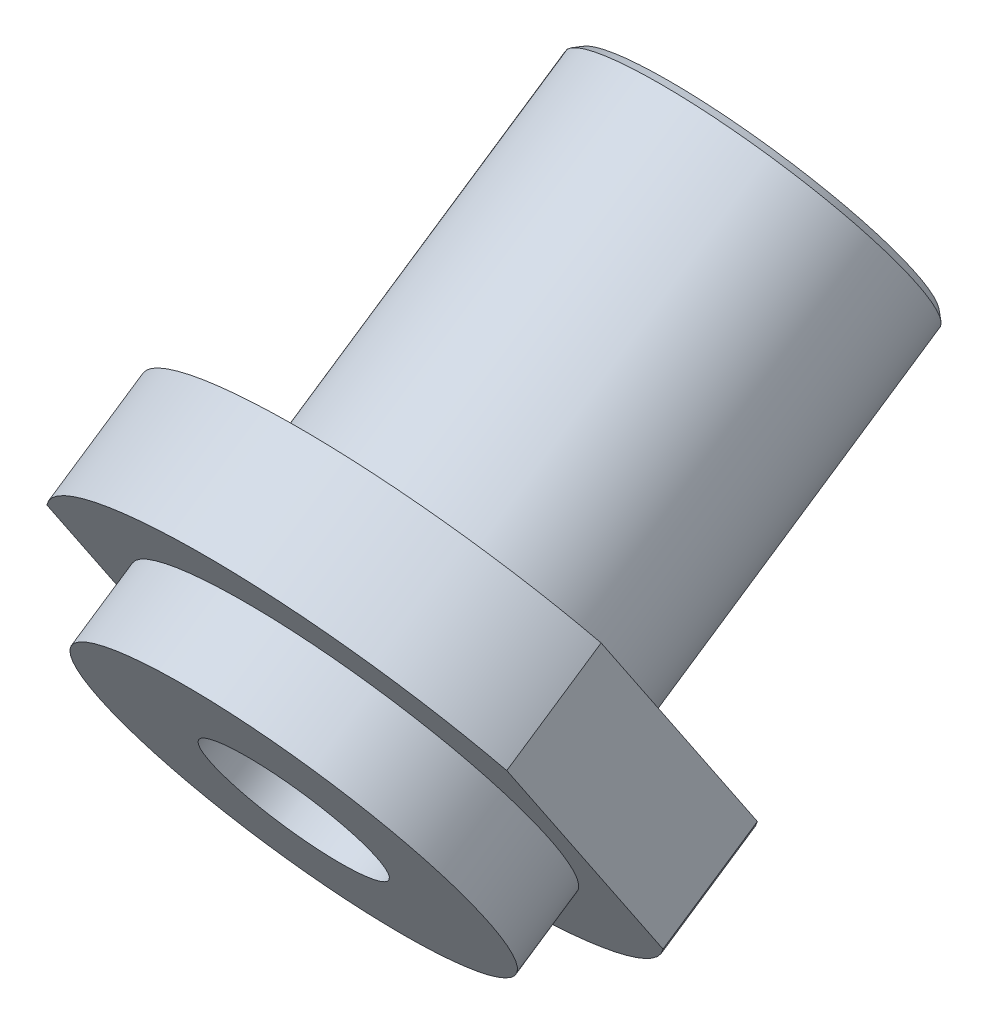
ISO-10303-21;
HEADER;
FILE_DESCRIPTION(('STEP AP214'),'2;1');
FILE_NAME('part.step','',(''),(''),'','','');
FILE_SCHEMA(('AUTOMOTIVE_DESIGN { 1 0 10303 214 1 1 1 1 }'));
ENDSEC;
DATA;
#1=APPLICATION_CONTEXT('core data for automotive mechanical design processes');
#2=APPLICATION_PROTOCOL_DEFINITION('international standard','automotive_design',2000,#1);
#3=PRODUCT_CONTEXT('',#1,'mechanical');
#4=PRODUCT('Part','Part','',(#3));
#5=PRODUCT_RELATED_PRODUCT_CATEGORY('part','',(#4));
#6=PRODUCT_DEFINITION_FORMATION('','',#4);
#7=PRODUCT_DEFINITION_CONTEXT('part definition',#1,'design');
#8=PRODUCT_DEFINITION('design','',#6,#7);
#9=PRODUCT_DEFINITION_SHAPE('','',#8);
#10=(LENGTH_UNIT() NAMED_UNIT(*) SI_UNIT(.MILLI.,.METRE.));
#11=(NAMED_UNIT(*) PLANE_ANGLE_UNIT() SI_UNIT($,.RADIAN.));
#12=(NAMED_UNIT(*) SI_UNIT($,.STERADIAN.) SOLID_ANGLE_UNIT());
#13=UNCERTAINTY_MEASURE_WITH_UNIT(LENGTH_MEASURE(1.E-05),#10,'distance_accuracy_value','');
#14=(GEOMETRIC_REPRESENTATION_CONTEXT(3) GLOBAL_UNCERTAINTY_ASSIGNED_CONTEXT((#13)) GLOBAL_UNIT_ASSIGNED_CONTEXT((#10,
#11,#12)) REPRESENTATION_CONTEXT('',''));
#15=CARTESIAN_POINT('',(0.,0.,0.));
#16=DIRECTION('',(0.,0.,1.));
#17=DIRECTION('',(1.,0.,0.));
#18=AXIS2_PLACEMENT_3D('',#15,#16,#17);
#19=CARTESIAN_POINT('',(0.,323.386403518482,387.567519724111));
#20=DIRECTION('',(0.,-0.557351153495909,0.830276876527812));
#21=DIRECTION('',(0.,-0.830276876527812,-0.557351153495909));
#22=AXIS2_PLACEMENT_3D('',#19,#20,#21);
#23=CYLINDRICAL_SURFACE('',#22,6.69289999999993);
#24=CARTESIAN_POINT('',(0.,323.244836325494,387.778410050749));
#25=DIRECTION('',(0.,-0.55735115349587,0.830276876527838));
#26=DIRECTION('',(0.,-0.830276876527838,-0.55735115349587));
#27=AXIS2_PLACEMENT_3D('',#24,#25,#26);
#28=CIRCLE('',#27,6.69289999999993);
#29=CARTESIAN_POINT('',(0.,317.687876218581,384.048114515517));
#30=VERTEX_POINT('',#29);
#31=EDGE_CURVE('E50',#30,#30,#28,.T.);
#32=ORIENTED_EDGE('',*,*,#31,.T.);
#33=EDGE_LOOP('',(#32));
#34=FACE_BOUND('',#33,.T.);
#35=CARTESIAN_POINT('',(0.,314.963155535699,400.115494159076));
#36=DIRECTION('',(0.,-0.557351153495909,0.830276876527812));
#37=DIRECTION('',(0.,-0.830276876527812,-0.557351153495909));
#38=AXIS2_PLACEMENT_3D('',#35,#36,#37);
#39=CIRCLE('',#38,6.69289999999993);
#40=CARTESIAN_POINT('',(0.,309.406195428786,396.385198623844));
#41=VERTEX_POINT('',#40);
#42=EDGE_CURVE('E119',#41,#41,#39,.T.);
#43=ORIENTED_EDGE('',*,*,#42,.F.);
#44=EDGE_LOOP('',(#43));
#45=FACE_BOUND('',#44,.T.);
#46=ADVANCED_FACE('F40',(#34,#45),#23,.T.);
#47=CARTESIAN_POINT('',(0.,323.386403518482,387.567519724111));
#48=DIRECTION('',(0.,-0.557351153495909,0.830276876527812));
#49=DIRECTION('',(0.,-0.830276876527812,-0.557351153495909));
#50=AXIS2_PLACEMENT_3D('',#47,#48,#49);
#51=PLANE('',#50);
#52=CARTESIAN_POINT('',(0.,323.386403518482,387.567519724111));
#53=DIRECTION('',(0.,-0.557351153495909,0.830276876527812));
#54=DIRECTION('',(0.,-0.830276876527812,-0.557351153495909));
#55=AXIS2_PLACEMENT_3D('',#52,#53,#54);
#56=CIRCLE('',#55,6.43889999999962);
#57=CARTESIAN_POINT('',(0.,318.040333738208,383.978791381867));
#58=VERTEX_POINT('',#57);
#59=EDGE_CURVE('E11',#58,#58,#56,.F.);
#60=ORIENTED_EDGE('',*,*,#59,.T.);
#61=EDGE_LOOP('',(#60));
#62=FACE_BOUND('',#61,.T.);
#63=CARTESIAN_POINT('',(1.50066244121372E-13,323.386403518482,387.567519724111));
#64=DIRECTION('',(0.,-0.557351153495909,0.830276876527812));
#65=DIRECTION('',(0.,-0.830276876527812,-0.557351153495909));
#66=AXIS2_PLACEMENT_3D('',#63,#64,#65);
#67=CIRCLE('',#66,3.4);
#68=CARTESIAN_POINT('',(1.50066244121372E-13,320.563462138288,385.672525802225));
#69=VERTEX_POINT('',#68);
#70=EDGE_CURVE('E179',#69,#69,#67,.T.);
#71=ORIENTED_EDGE('',*,*,#70,.T.);
#72=EDGE_LOOP('',(#71));
#73=FACE_BOUND('',#72,.T.);
#74=ADVANCED_FACE('F137',(#62,#73),#51,.F.);
#75=CARTESIAN_POINT('',(-9.34974000002021,-89.8906110312634,133.908569647845));
#76=DIRECTION('',(-1.,0.,0.));
#77=DIRECTION('',(0.,0.,1.));
#78=AXIS2_PLACEMENT_3D('',#75,#76,#77);
#79=PLANE('',#78);
#80=DIRECTION('',(0.,0.830276876527812,0.557351153495909));
#81=VECTOR('',#80,1.);
#82=CARTESIAN_POINT('',(-9.34974000002021,-87.3155037908124,130.072474606299));
#83=LINE('',#82,#81);
#84=CARTESIAN_POINT('',(-9.34974000002021,310.23104727509,396.938908044156));
#85=VERTEX_POINT('',#84);
#86=CARTESIAN_POINT('',(-9.34974000002021,319.695263796307,403.292080273996));
#87=VERTEX_POINT('',#86);
#88=EDGE_CURVE('E108',#85,#87,#83,.T.);
#89=ORIENTED_EDGE('',*,*,#88,.F.);
#90=DIRECTION('',(0.,0.557351153495909,-0.830276876527812));
#91=VECTOR('',#90,1.);
#92=CARTESIAN_POINT('',(-9.34974000002021,307.655940034639,400.775003085703));
#93=LINE('',#92,#91);
#94=CARTESIAN_POINT('',(-9.34974000002021,307.655940034639,400.775003085703));
#95=VERTEX_POINT('',#94);
#96=EDGE_CURVE('E86',#95,#85,#93,.T.);
#97=ORIENTED_EDGE('',*,*,#96,.F.);
#98=DIRECTION('',(0.,0.830276876527812,0.557351153495909));
#99=VECTOR('',#98,1.);
#100=CARTESIAN_POINT('',(-9.34974000002021,-89.8906110312634,133.908569647845));
#101=LINE('',#100,#99);
#102=CARTESIAN_POINT('',(-9.34974000002021,317.120156555856,407.128175315543));
#103=VERTEX_POINT('',#102);
#104=EDGE_CURVE('E94',#95,#103,#101,.T.);
#105=ORIENTED_EDGE('',*,*,#104,.T.);
#106=DIRECTION('',(0.,0.557351153495909,-0.830276876527812));
#107=VECTOR('',#106,1.);
#108=CARTESIAN_POINT('',(-9.34974000002021,317.120156555856,407.128175315543));
#109=LINE('',#108,#107);
#110=EDGE_CURVE('E82',#103,#87,#109,.T.);
#111=ORIENTED_EDGE('',*,*,#110,.T.);
#112=EDGE_LOOP('',(#89,#97,#105,#111));
#113=FACE_BOUND('',#112,.T.);
#114=ADVANCED_FACE('F141',(#113),#79,.T.);
#115=CARTESIAN_POINT('',(0.,312.388048295248,403.951589200623));
#116=DIRECTION('',(0.,0.557351153495909,-0.830276876527812));
#117=DIRECTION('',(0.,0.830276876527812,0.557351153495909));
#118=AXIS2_PLACEMENT_3D('',#115,#116,#117);
#119=CYLINDRICAL_SURFACE('',#118,10.9499399999999);
#120=CARTESIAN_POINT('',(0.,314.963155535699,400.115494159076));
#121=DIRECTION('',(0.,-0.557351153495909,0.830276876527812));
#122=DIRECTION('',(0.,-0.830276876527812,-0.557351153495909));
#123=AXIS2_PLACEMENT_3D('',#120,#121,#122);
#124=CIRCLE('',#123,10.9499399999999);
#125=CARTESIAN_POINT('',(9.34974000002031,310.23104727509,396.938908044156));
#126=VERTEX_POINT('',#125);
#127=EDGE_CURVE('E100',#85,#126,#124,.T.);
#128=ORIENTED_EDGE('',*,*,#127,.T.);
#129=DIRECTION('',(0.,0.557351153495909,-0.830276876527812));
#130=VECTOR('',#129,1.);
#131=CARTESIAN_POINT('',(9.34974000002031,307.655940034639,400.775003085703));
#132=LINE('',#131,#130);
#133=CARTESIAN_POINT('',(9.34974000002031,307.655940034639,400.775003085703));
#134=VERTEX_POINT('',#133);
#135=EDGE_CURVE('E97',#134,#126,#132,.T.);
#136=ORIENTED_EDGE('',*,*,#135,.F.);
#137=CARTESIAN_POINT('',(0.,312.388048295248,403.951589200623));
#138=DIRECTION('',(0.,-0.557351153495909,0.830276876527812));
#139=DIRECTION('',(0.,-0.830276876527812,-0.557351153495909));
#140=AXIS2_PLACEMENT_3D('',#137,#138,#139);
#141=CIRCLE('',#140,10.9499399999999);
#142=EDGE_CURVE('E89',#95,#134,#141,.T.);
#143=ORIENTED_EDGE('',*,*,#142,.F.);
#144=ORIENTED_EDGE('',*,*,#96,.T.);
#145=EDGE_LOOP('',(#128,#136,#143,#144));
#146=FACE_BOUND('',#145,.T.);
#147=ADVANCED_FACE('F98',(#146),#119,.T.);
#148=CARTESIAN_POINT('',(9.34974000002024,-89.8906110312634,133.908569647845));
#149=DIRECTION('',(-1.,0.,0.));
#150=DIRECTION('',(0.,-1.,0.));
#151=AXIS2_PLACEMENT_3D('',#148,#149,#150);
#152=PLANE('',#151);
#153=DIRECTION('',(0.,0.830276876527812,0.557351153495909));
#154=VECTOR('',#153,1.);
#155=CARTESIAN_POINT('',(9.34974000002024,-87.3155037908124,130.072474606299));
#156=LINE('',#155,#154);
#157=CARTESIAN_POINT('',(9.34974000002032,319.695263796307,403.292080273996));
#158=VERTEX_POINT('',#157);
#159=EDGE_CURVE('E75',#126,#158,#156,.T.);
#160=ORIENTED_EDGE('',*,*,#159,.T.);
#161=DIRECTION('',(0.,0.557351153495909,-0.830276876527812));
#162=VECTOR('',#161,1.);
#163=CARTESIAN_POINT('',(9.34974000002032,317.120156555856,407.128175315543));
#164=LINE('',#163,#162);
#165=CARTESIAN_POINT('',(9.34974000002032,317.120156555856,407.128175315543));
#166=VERTEX_POINT('',#165);
#167=EDGE_CURVE('E101',#166,#158,#164,.T.);
#168=ORIENTED_EDGE('',*,*,#167,.F.);
#169=DIRECTION('',(0.,0.830276876527812,0.557351153495909));
#170=VECTOR('',#169,1.);
#171=CARTESIAN_POINT('',(9.34974000002024,-89.8906110312634,133.908569647845));
#172=LINE('',#171,#170);
#173=EDGE_CURVE('E93',#134,#166,#172,.T.);
#174=ORIENTED_EDGE('',*,*,#173,.F.);
#175=ORIENTED_EDGE('',*,*,#135,.T.);
#176=EDGE_LOOP('',(#160,#168,#174,#175));
#177=FACE_BOUND('',#176,.T.);
#178=ADVANCED_FACE('F103',(#177),#152,.F.);
#179=CARTESIAN_POINT('',(0.,312.388048295248,403.951589200623));
#180=DIRECTION('',(0.,0.557351153495909,-0.830276876527812));
#181=DIRECTION('',(0.,0.830276876527812,0.557351153495909));
#182=AXIS2_PLACEMENT_3D('',#179,#180,#181);
#183=CYLINDRICAL_SURFACE('',#182,10.9499399999999);
#184=CARTESIAN_POINT('',(0.,314.963155535699,400.115494159076));
#185=DIRECTION('',(0.,-0.557351153495909,0.830276876527812));
#186=DIRECTION('',(0.,-0.830276876527812,-0.557351153495909));
#187=AXIS2_PLACEMENT_3D('',#184,#185,#186);
#188=CIRCLE('',#187,10.9499399999999);
#189=EDGE_CURVE('E114',#158,#87,#188,.T.);
#190=ORIENTED_EDGE('',*,*,#189,.T.);
#191=ORIENTED_EDGE('',*,*,#110,.F.);
#192=CARTESIAN_POINT('',(0.,312.388048295248,403.951589200623));
#193=DIRECTION('',(0.,-0.557351153495909,0.830276876527812));
#194=DIRECTION('',(0.,-0.830276876527812,-0.557351153495909));
#195=AXIS2_PLACEMENT_3D('',#192,#193,#194);
#196=CIRCLE('',#195,10.9499399999999);
#197=EDGE_CURVE('E58',#166,#103,#196,.T.);
#198=ORIENTED_EDGE('',*,*,#197,.F.);
#199=ORIENTED_EDGE('',*,*,#167,.T.);
#200=EDGE_LOOP('',(#190,#191,#198,#199));
#201=FACE_BOUND('',#200,.T.);
#202=ADVANCED_FACE('F151',(#201),#183,.T.);
#203=CARTESIAN_POINT('',(0.,-89.8906110312634,133.908569647845));
#204=DIRECTION('',(0.,-0.557351153495909,0.830276876527812));
#205=DIRECTION('',(0.,-0.830276876527812,-0.557351153495909));
#206=AXIS2_PLACEMENT_3D('',#203,#204,#205);
#207=PLANE('',#206);
#208=CARTESIAN_POINT('',(1.48817351465413E-13,312.388048295247,403.951589200623));
#209=DIRECTION('',(0.,-0.55735115349591,0.830276876527812));
#210=DIRECTION('',(0.,-0.830276876527812,-0.557351153495909));
#211=AXIS2_PLACEMENT_3D('',#208,#209,#210);
#212=CIRCLE('',#211,7.9502);
#213=CARTESIAN_POINT('',(1.48817351465413E-13,305.787181071476,399.5205360601));
#214=VERTEX_POINT('',#213);
#215=EDGE_CURVE('E176',#214,#214,#212,.T.);
#216=ORIENTED_EDGE('',*,*,#215,.F.);
#217=EDGE_LOOP('',(#216));
#218=FACE_BOUND('',#217,.T.);
#219=ORIENTED_EDGE('',*,*,#104,.F.);
#220=ORIENTED_EDGE('',*,*,#142,.T.);
#221=ORIENTED_EDGE('',*,*,#173,.T.);
#222=ORIENTED_EDGE('',*,*,#197,.T.);
#223=EDGE_LOOP('',(#219,#220,#221,#222));
#224=FACE_BOUND('',#223,.T.);
#225=ADVANCED_FACE('F91',(#218,#224),#207,.T.);
#226=CARTESIAN_POINT('',(0.,-87.3155037908124,130.072474606299));
#227=DIRECTION('',(0.,-0.557351153495909,0.830276876527812));
#228=DIRECTION('',(0.,-0.830276876527812,-0.557351153495909));
#229=AXIS2_PLACEMENT_3D('',#226,#227,#228);
#230=PLANE('',#229);
#231=ORIENTED_EDGE('',*,*,#42,.T.);
#232=EDGE_LOOP('',(#231));
#233=FACE_BOUND('',#232,.T.);
#234=ORIENTED_EDGE('',*,*,#88,.T.);
#235=ORIENTED_EDGE('',*,*,#189,.F.);
#236=ORIENTED_EDGE('',*,*,#159,.F.);
#237=ORIENTED_EDGE('',*,*,#127,.F.);
#238=EDGE_LOOP('',(#234,#235,#236,#237));
#239=FACE_BOUND('',#238,.T.);
#240=ADVANCED_FACE('F155',(#233,#239),#230,.F.);
#241=CARTESIAN_POINT('',(1.50066244121372E-13,310.71613974606,406.442203958218));
#242=DIRECTION('',(0.,0.557351153495909,-0.830276876527812));
#243=DIRECTION('',(0.,0.830276876527812,0.55735115349591));
#244=AXIS2_PLACEMENT_3D('',#241,#242,#243);
#245=CYLINDRICAL_SURFACE('',#244,7.9502);
#246=CARTESIAN_POINT('',(1.50066244121372E-13,310.71613974606,406.442203958218));
#247=DIRECTION('',(0.,-0.55735115349591,0.830276876527812));
#248=DIRECTION('',(0.,-0.830276876527812,-0.557351153495909));
#249=AXIS2_PLACEMENT_3D('',#246,#247,#248);
#250=CIRCLE('',#249,7.9502);
#251=CARTESIAN_POINT('',(1.50066244121372E-13,304.115272522288,402.011150817695));
#252=VERTEX_POINT('',#251);
#253=EDGE_CURVE('E111',#252,#252,#250,.T.);
#254=ORIENTED_EDGE('',*,*,#253,.F.);
#255=EDGE_LOOP('',(#254));
#256=FACE_BOUND('',#255,.T.);
#257=ORIENTED_EDGE('',*,*,#215,.T.);
#258=EDGE_LOOP('',(#257));
#259=FACE_BOUND('',#258,.T.);
#260=ADVANCED_FACE('F158',(#256,#259),#245,.T.);
#261=CARTESIAN_POINT('',(1.50066244121372E-13,310.71613974606,406.442203958218));
#262=DIRECTION('',(0.,-0.55735115349591,0.830276876527812));
#263=DIRECTION('',(0.,-0.830276876527812,-0.557351153495909));
#264=AXIS2_PLACEMENT_3D('',#261,#262,#263);
#265=PLANE('',#264);
#266=CARTESIAN_POINT('',(1.50066244121372E-13,310.71613974606,406.442203958218));
#267=DIRECTION('',(0.,-0.557351153495909,0.830276876527812));
#268=DIRECTION('',(0.,-0.830276876527812,-0.557351153495909));
#269=AXIS2_PLACEMENT_3D('',#266,#267,#268);
#270=CIRCLE('',#269,3.4);
#271=CARTESIAN_POINT('',(1.50066244121372E-13,307.893198365865,404.547210036332));
#272=VERTEX_POINT('',#271);
#273=EDGE_CURVE('E173',#272,#272,#270,.T.);
#274=ORIENTED_EDGE('',*,*,#273,.F.);
#275=EDGE_LOOP('',(#274));
#276=FACE_BOUND('',#275,.T.);
#277=ORIENTED_EDGE('',*,*,#253,.T.);
#278=EDGE_LOOP('',(#277));
#279=FACE_BOUND('',#278,.T.);
#280=ADVANCED_FACE('F132',(#276,#279),#265,.T.);
#281=CARTESIAN_POINT('',(1.50066244121372E-13,310.71613974606,406.442203958218));
#282=DIRECTION('',(0.,-0.557351153495909,0.830276876527812));
#283=DIRECTION('',(0.,-0.830276876527812,-0.557351153495909));
#284=AXIS2_PLACEMENT_3D('',#281,#282,#283);
#285=CYLINDRICAL_SURFACE('',#284,3.4);
#286=ORIENTED_EDGE('',*,*,#273,.T.);
#287=EDGE_LOOP('',(#286));
#288=FACE_BOUND('',#287,.T.);
#289=ORIENTED_EDGE('',*,*,#70,.F.);
#290=EDGE_LOOP('',(#289));
#291=FACE_BOUND('',#290,.T.);
#292=ADVANCED_FACE('F127',(#288,#291),#285,.F.);
#293=CARTESIAN_POINT('',(0.,323.244836325494,387.778410050749));
#294=DIRECTION('',(0.,-0.55735115349587,0.830276876527838));
#295=DIRECTION('',(0.,-0.830276876527838,-0.55735115349587));
#296=AXIS2_PLACEMENT_3D('',#293,#294,#295);
#297=CONICAL_SURFACE('',#296,6.69289999999993,0.785398163397611);
#298=ORIENTED_EDGE('',*,*,#59,.F.);
#299=EDGE_LOOP('',(#298));
#300=FACE_BOUND('',#299,.T.);
#301=ORIENTED_EDGE('',*,*,#31,.F.);
#302=EDGE_LOOP('',(#301));
#303=FACE_BOUND('',#302,.T.);
#304=ADVANCED_FACE('F43',(#300,#303),#297,.T.);
#305=CLOSED_SHELL('',(#46,#74,#114,#147,#178,#202,#225,#240,#260,#280,#292,#304));
#306=MANIFOLD_SOLID_BREP('B2',#305);
#307=ADVANCED_BREP_SHAPE_REPRESENTATION('',(#18,#306),#14);
#308=SHAPE_DEFINITION_REPRESENTATION(#9,#307);
ENDSEC;
END-ISO-10303-21;
